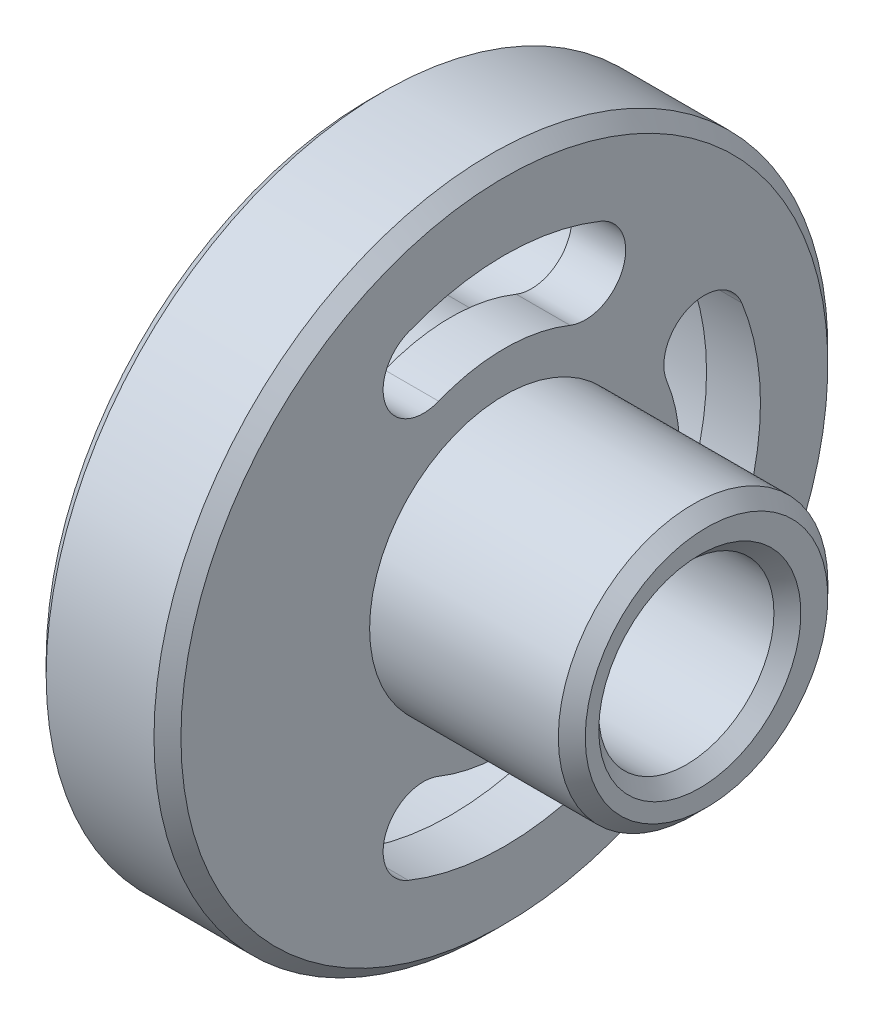
ISO-10303-21;
HEADER;
FILE_DESCRIPTION(('STEP AP214'),'2;1');
FILE_NAME('part.step','',(''),(''),'','','');
FILE_SCHEMA(('AUTOMOTIVE_DESIGN { 1 0 10303 214 1 1 1 1 }'));
ENDSEC;
DATA;
#1=APPLICATION_CONTEXT('core data for automotive mechanical design processes');
#2=APPLICATION_PROTOCOL_DEFINITION('international standard','automotive_design',2000,#1);
#3=PRODUCT_CONTEXT('',#1,'mechanical');
#4=PRODUCT('Part','Part','',(#3));
#5=PRODUCT_RELATED_PRODUCT_CATEGORY('part','',(#4));
#6=PRODUCT_DEFINITION_FORMATION('','',#4);
#7=PRODUCT_DEFINITION_CONTEXT('part definition',#1,'design');
#8=PRODUCT_DEFINITION('design','',#6,#7);
#9=PRODUCT_DEFINITION_SHAPE('','',#8);
#10=(LENGTH_UNIT() NAMED_UNIT(*) SI_UNIT(.MILLI.,.METRE.));
#11=(NAMED_UNIT(*) PLANE_ANGLE_UNIT() SI_UNIT($,.RADIAN.));
#12=(NAMED_UNIT(*) SI_UNIT($,.STERADIAN.) SOLID_ANGLE_UNIT());
#13=UNCERTAINTY_MEASURE_WITH_UNIT(LENGTH_MEASURE(1.E-05),#10,'distance_accuracy_value','');
#14=(GEOMETRIC_REPRESENTATION_CONTEXT(3) GLOBAL_UNCERTAINTY_ASSIGNED_CONTEXT((#13)) GLOBAL_UNIT_ASSIGNED_CONTEXT((#10,
#11,#12)) REPRESENTATION_CONTEXT('',''));
#15=CARTESIAN_POINT('',(0.,0.,0.));
#16=DIRECTION('',(0.,0.,1.));
#17=DIRECTION('',(1.,0.,0.));
#18=AXIS2_PLACEMENT_3D('',#15,#16,#17);
#19=CARTESIAN_POINT('',(0.,0.,0.));
#20=DIRECTION('',(1.,0.,0.));
#21=DIRECTION('',(0.,0.,-1.));
#22=AXIS2_PLACEMENT_3D('',#19,#20,#21);
#23=PLANE('',#22);
#24=CARTESIAN_POINT('',(0.,0.,0.5));
#25=DIRECTION('',(1.,0.,0.));
#26=DIRECTION('',(0.,0.,-1.));
#27=AXIS2_PLACEMENT_3D('',#24,#25,#26);
#28=CIRCLE('',#27,7.49999999999999);
#29=CARTESIAN_POINT('',(0.,0.,-6.99999999999999));
#30=VERTEX_POINT('',#29);
#31=EDGE_CURVE('E57',#30,#30,#28,.T.);
#32=ORIENTED_EDGE('',*,*,#31,.T.);
#33=EDGE_LOOP('',(#32));
#34=FACE_BOUND('',#33,.T.);
#35=CARTESIAN_POINT('',(0.,-6.00000000000006,-14.8323969741913));
#36=DIRECTION('',(-1.,0.,0.));
#37=DIRECTION('',(0.,0.,1.));
#38=AXIS2_PLACEMENT_3D('',#35,#36,#37);
#39=CIRCLE('',#38,5.);
#40=CARTESIAN_POINT('',(0.,-7.87500000000007,-19.4675210286261));
#41=VERTEX_POINT('',#40);
#42=CARTESIAN_POINT('',(0.,-4.12500000000004,-10.1972729197565));
#43=VERTEX_POINT('',#42);
#44=EDGE_CURVE('E340',#41,#43,#39,.T.);
#45=ORIENTED_EDGE('',*,*,#44,.F.);
#46=CARTESIAN_POINT('',(0.,0.,0.));
#47=DIRECTION('',(-1.,0.,0.));
#48=DIRECTION('',(0.,0.,1.));
#49=AXIS2_PLACEMENT_3D('',#46,#47,#48);
#50=CIRCLE('',#49,21.);
#51=CARTESIAN_POINT('',(0.,7.87499999999992,-19.4675210286261));
#52=VERTEX_POINT('',#51);
#53=EDGE_CURVE('E344',#52,#41,#50,.T.);
#54=ORIENTED_EDGE('',*,*,#53,.F.);
#55=CARTESIAN_POINT('',(0.,5.99999999999994,-14.8323969741913));
#56=DIRECTION('',(-1.,0.,0.));
#57=DIRECTION('',(0.,0.,1.));
#58=AXIS2_PLACEMENT_3D('',#55,#56,#57);
#59=CIRCLE('',#58,5.);
#60=CARTESIAN_POINT('',(0.,4.12499999999996,-10.1972729197565));
#61=VERTEX_POINT('',#60);
#62=EDGE_CURVE('E331',#61,#52,#59,.T.);
#63=ORIENTED_EDGE('',*,*,#62,.F.);
#64=CARTESIAN_POINT('',(0.,0.,0.));
#65=DIRECTION('',(1.,0.,0.));
#66=DIRECTION('',(0.,0.,1.));
#67=AXIS2_PLACEMENT_3D('',#64,#65,#66);
#68=CIRCLE('',#67,11.);
#69=EDGE_CURVE('E335',#43,#61,#68,.T.);
#70=ORIENTED_EDGE('',*,*,#69,.F.);
#71=EDGE_LOOP('',(#45,#54,#63,#70));
#72=FACE_BOUND('',#71,.T.);
#73=CARTESIAN_POINT('',(0.,-14.8323969741913,6.00000000000011));
#74=DIRECTION('',(-1.,0.,0.));
#75=DIRECTION('',(0.,0.,1.));
#76=AXIS2_PLACEMENT_3D('',#73,#74,#75);
#77=CIRCLE('',#76,5.);
#78=CARTESIAN_POINT('',(0.,-19.4675210286261,7.87500000000014));
#79=VERTEX_POINT('',#78);
#80=CARTESIAN_POINT('',(0.,-10.1972729197565,4.12500000000007));
#81=VERTEX_POINT('',#80);
#82=EDGE_CURVE('E296',#79,#81,#77,.T.);
#83=ORIENTED_EDGE('',*,*,#82,.F.);
#84=CARTESIAN_POINT('',(0.,0.,0.));
#85=DIRECTION('',(-1.,0.,0.));
#86=DIRECTION('',(0.,0.,1.));
#87=AXIS2_PLACEMENT_3D('',#84,#85,#86);
#88=CIRCLE('',#87,21.);
#89=CARTESIAN_POINT('',(0.,-19.4675210286262,-7.87499999999986));
#90=VERTEX_POINT('',#89);
#91=EDGE_CURVE('E300',#90,#79,#88,.T.);
#92=ORIENTED_EDGE('',*,*,#91,.F.);
#93=CARTESIAN_POINT('',(0.,-14.8323969741914,-5.99999999999989));
#94=DIRECTION('',(-1.,0.,0.));
#95=DIRECTION('',(0.,0.,1.));
#96=AXIS2_PLACEMENT_3D('',#93,#94,#95);
#97=CIRCLE('',#96,5.);
#98=CARTESIAN_POINT('',(0.,-10.1972729197566,-4.12499999999993));
#99=VERTEX_POINT('',#98);
#100=EDGE_CURVE('E287',#99,#90,#97,.T.);
#101=ORIENTED_EDGE('',*,*,#100,.F.);
#102=CARTESIAN_POINT('',(0.,0.,0.));
#103=DIRECTION('',(1.,0.,0.));
#104=DIRECTION('',(0.,0.,1.));
#105=AXIS2_PLACEMENT_3D('',#102,#103,#104);
#106=CIRCLE('',#105,11.);
#107=EDGE_CURVE('E291',#81,#99,#106,.T.);
#108=ORIENTED_EDGE('',*,*,#107,.F.);
#109=EDGE_LOOP('',(#83,#92,#101,#108));
#110=FACE_BOUND('',#109,.T.);
#111=CARTESIAN_POINT('',(0.,0.,0.));
#112=DIRECTION('',(-1.,0.,0.));
#113=DIRECTION('',(0.,0.,1.));
#114=AXIS2_PLACEMENT_3D('',#111,#112,#113);
#115=CIRCLE('',#114,21.);
#116=CARTESIAN_POINT('',(0.,19.4675210286261,7.875));
#117=VERTEX_POINT('',#116);
#118=CARTESIAN_POINT('',(0.,19.4675210286261,-7.875));
#119=VERTEX_POINT('',#118);
#120=EDGE_CURVE('E382',#117,#119,#115,.T.);
#121=ORIENTED_EDGE('',*,*,#120,.F.);
#122=CARTESIAN_POINT('',(0.,14.8323969741913,6.));
#123=DIRECTION('',(-1.,0.,0.));
#124=DIRECTION('',(0.,0.,1.));
#125=AXIS2_PLACEMENT_3D('',#122,#123,#124);
#126=CIRCLE('',#125,5.);
#127=CARTESIAN_POINT('',(0.,10.1972729197565,4.125));
#128=VERTEX_POINT('',#127);
#129=EDGE_CURVE('E347',#128,#117,#126,.T.);
#130=ORIENTED_EDGE('',*,*,#129,.F.);
#131=CARTESIAN_POINT('',(0.,0.,0.));
#132=DIRECTION('',(1.,0.,0.));
#133=DIRECTION('',(0.,0.,1.));
#134=AXIS2_PLACEMENT_3D('',#131,#132,#133);
#135=CIRCLE('',#134,11.);
#136=CARTESIAN_POINT('',(0.,10.1972729197565,-4.125));
#137=VERTEX_POINT('',#136);
#138=EDGE_CURVE('E367',#137,#128,#135,.T.);
#139=ORIENTED_EDGE('',*,*,#138,.F.);
#140=CARTESIAN_POINT('',(0.,14.8323969741913,-6.));
#141=DIRECTION('',(-1.,0.,0.));
#142=DIRECTION('',(0.,0.,1.));
#143=AXIS2_PLACEMENT_3D('',#140,#141,#142);
#144=CIRCLE('',#143,5.);
#145=EDGE_CURVE('E386',#119,#137,#144,.T.);
#146=ORIENTED_EDGE('',*,*,#145,.F.);
#147=EDGE_LOOP('',(#121,#130,#139,#146));
#148=FACE_BOUND('',#147,.T.);
#149=CARTESIAN_POINT('',(0.,0.,0.));
#150=DIRECTION('',(-1.,0.,0.));
#151=DIRECTION('',(0.,0.,1.));
#152=AXIS2_PLACEMENT_3D('',#149,#150,#151);
#153=CIRCLE('',#152,24.);
#154=CARTESIAN_POINT('',(0.,0.,24.));
#155=VERTEX_POINT('',#154);
#156=EDGE_CURVE('E429',#155,#155,#153,.T.);
#157=ORIENTED_EDGE('',*,*,#156,.T.);
#158=EDGE_LOOP('',(#157));
#159=FACE_BOUND('',#158,.T.);
#160=ADVANCED_FACE('F47',(#34,#72,#110,#148,#159),#23,.F.);
#161=CARTESIAN_POINT('',(1.,0.,0.));
#162=DIRECTION('',(1.,0.,0.));
#163=DIRECTION('',(0.,0.,-1.));
#164=AXIS2_PLACEMENT_3D('',#161,#162,#163);
#165=CONICAL_SURFACE('',#164,25.,0.785398163397449);
#166=ORIENTED_EDGE('',*,*,#156,.F.);
#167=EDGE_LOOP('',(#166));
#168=FACE_BOUND('',#167,.T.);
#169=CARTESIAN_POINT('',(1.,0.,0.));
#170=DIRECTION('',(-1.,0.,0.));
#171=DIRECTION('',(0.,0.,1.));
#172=AXIS2_PLACEMENT_3D('',#169,#170,#171);
#173=CIRCLE('',#172,25.);
#174=CARTESIAN_POINT('',(1.,0.,25.));
#175=VERTEX_POINT('',#174);
#176=EDGE_CURVE('E425',#175,#175,#173,.T.);
#177=ORIENTED_EDGE('',*,*,#176,.T.);
#178=EDGE_LOOP('',(#177));
#179=FACE_BOUND('',#178,.T.);
#180=ADVANCED_FACE('F494',(#168,#179),#165,.T.);
#181=CARTESIAN_POINT('',(0.,0.,0.));
#182=DIRECTION('',(-1.,0.,0.));
#183=DIRECTION('',(0.,0.,1.));
#184=AXIS2_PLACEMENT_3D('',#181,#182,#183);
#185=CYLINDRICAL_SURFACE('',#184,25.);
#186=ORIENTED_EDGE('',*,*,#176,.F.);
#187=EDGE_LOOP('',(#186));
#188=FACE_BOUND('',#187,.T.);
#189=CARTESIAN_POINT('',(9.,0.,0.));
#190=DIRECTION('',(-1.,0.,0.));
#191=DIRECTION('',(0.,0.,1.));
#192=AXIS2_PLACEMENT_3D('',#189,#190,#191);
#193=CIRCLE('',#192,25.);
#194=CARTESIAN_POINT('',(9.,0.,25.));
#195=VERTEX_POINT('',#194);
#196=EDGE_CURVE('E421',#195,#195,#193,.T.);
#197=ORIENTED_EDGE('',*,*,#196,.T.);
#198=EDGE_LOOP('',(#197));
#199=FACE_BOUND('',#198,.T.);
#200=ADVANCED_FACE('F499',(#188,#199),#185,.T.);
#201=CARTESIAN_POINT('',(10.,0.,0.));
#202=DIRECTION('',(-1.,0.,0.));
#203=DIRECTION('',(0.,0.,1.));
#204=AXIS2_PLACEMENT_3D('',#201,#202,#203);
#205=CONICAL_SURFACE('',#204,24.,0.785398163397449);
#206=ORIENTED_EDGE('',*,*,#196,.F.);
#207=EDGE_LOOP('',(#206));
#208=FACE_BOUND('',#207,.T.);
#209=CARTESIAN_POINT('',(10.,0.,0.));
#210=DIRECTION('',(-1.,0.,0.));
#211=DIRECTION('',(0.,0.,1.));
#212=AXIS2_PLACEMENT_3D('',#209,#210,#211);
#213=CIRCLE('',#212,24.);
#214=CARTESIAN_POINT('',(10.,0.,24.));
#215=VERTEX_POINT('',#214);
#216=EDGE_CURVE('E417',#215,#215,#213,.T.);
#217=ORIENTED_EDGE('',*,*,#216,.T.);
#218=EDGE_LOOP('',(#217));
#219=FACE_BOUND('',#218,.T.);
#220=ADVANCED_FACE('F510',(#208,#219),#205,.T.);
#221=CARTESIAN_POINT('',(10.,24.,0.));
#222=DIRECTION('',(-1.,0.,0.));
#223=DIRECTION('',(0.,0.,1.));
#224=AXIS2_PLACEMENT_3D('',#221,#222,#223);
#225=PLANE('',#224);
#226=CARTESIAN_POINT('',(10.,0.,0.));
#227=DIRECTION('',(-1.,0.,0.));
#228=DIRECTION('',(0.,0.,1.));
#229=AXIS2_PLACEMENT_3D('',#226,#227,#228);
#230=CIRCLE('',#229,13.);
#231=CARTESIAN_POINT('',(10.,12.0513225415304,-4.875));
#232=VERTEX_POINT('',#231);
#233=CARTESIAN_POINT('',(10.,12.0513225415305,4.875));
#234=VERTEX_POINT('',#233);
#235=EDGE_CURVE('E265',#232,#234,#230,.F.);
#236=ORIENTED_EDGE('',*,*,#235,.T.);
#237=CARTESIAN_POINT('',(10.,14.8323969741913,5.99999999999999));
#238=DIRECTION('',(-1.,0.,0.));
#239=DIRECTION('',(0.,0.,1.));
#240=AXIS2_PLACEMENT_3D('',#237,#238,#239);
#241=CIRCLE('',#240,3.);
#242=CARTESIAN_POINT('',(10.,17.6134714068522,7.125));
#243=VERTEX_POINT('',#242);
#244=EDGE_CURVE('E269',#234,#243,#241,.T.);
#245=ORIENTED_EDGE('',*,*,#244,.T.);
#246=CARTESIAN_POINT('',(10.,0.,0.));
#247=DIRECTION('',(-1.,0.,0.));
#248=DIRECTION('',(0.,0.,1.));
#249=AXIS2_PLACEMENT_3D('',#246,#247,#248);
#250=CIRCLE('',#249,19.);
#251=CARTESIAN_POINT('',(10.,17.6134714068522,-7.125));
#252=VERTEX_POINT('',#251);
#253=EDGE_CURVE('E257',#243,#252,#250,.T.);
#254=ORIENTED_EDGE('',*,*,#253,.T.);
#255=CARTESIAN_POINT('',(10.,14.8323969741913,-6.));
#256=DIRECTION('',(-1.,0.,0.));
#257=DIRECTION('',(0.,0.,1.));
#258=AXIS2_PLACEMENT_3D('',#255,#256,#257);
#259=CIRCLE('',#258,3.);
#260=EDGE_CURVE('E261',#252,#232,#259,.T.);
#261=ORIENTED_EDGE('',*,*,#260,.T.);
#262=EDGE_LOOP('',(#236,#245,#254,#261));
#263=FACE_BOUND('',#262,.T.);
#264=CARTESIAN_POINT('',(10.,6.00000000000054,-14.8323969741911));
#265=DIRECTION('',(-1.,0.,0.));
#266=DIRECTION('',(0.,0.,1.));
#267=AXIS2_PLACEMENT_3D('',#264,#265,#266);
#268=CIRCLE('',#267,3.);
#269=CARTESIAN_POINT('',(10.,4.87500000000044,-12.0513225415303));
#270=VERTEX_POINT('',#269);
#271=CARTESIAN_POINT('',(10.,7.12500000000065,-17.6134714068519));
#272=VERTEX_POINT('',#271);
#273=EDGE_CURVE('E234',#270,#272,#268,.T.);
#274=ORIENTED_EDGE('',*,*,#273,.T.);
#275=CARTESIAN_POINT('',(10.,0.,0.));
#276=DIRECTION('',(-1.,0.,0.));
#277=DIRECTION('',(0.,0.,1.));
#278=AXIS2_PLACEMENT_3D('',#275,#276,#277);
#279=CIRCLE('',#278,19.);
#280=CARTESIAN_POINT('',(10.,-7.12499999999935,-17.6134714068525));
#281=VERTEX_POINT('',#280);
#282=EDGE_CURVE('E223',#272,#281,#279,.T.);
#283=ORIENTED_EDGE('',*,*,#282,.T.);
#284=CARTESIAN_POINT('',(10.,-5.99999999999946,-14.8323969741915));
#285=DIRECTION('',(-1.,0.,0.));
#286=DIRECTION('',(0.,0.,1.));
#287=AXIS2_PLACEMENT_3D('',#284,#285,#286);
#288=CIRCLE('',#287,3.);
#289=CARTESIAN_POINT('',(10.,-4.87499999999955,-12.0513225415306));
#290=VERTEX_POINT('',#289);
#291=EDGE_CURVE('E208',#281,#290,#288,.T.);
#292=ORIENTED_EDGE('',*,*,#291,.T.);
#293=CARTESIAN_POINT('',(10.,0.,0.));
#294=DIRECTION('',(-1.,0.,0.));
#295=DIRECTION('',(0.,0.,1.));
#296=AXIS2_PLACEMENT_3D('',#293,#294,#295);
#297=CIRCLE('',#296,13.);
#298=EDGE_CURVE('E217',#290,#270,#297,.F.);
#299=ORIENTED_EDGE('',*,*,#298,.T.);
#300=EDGE_LOOP('',(#274,#283,#292,#299));
#301=FACE_BOUND('',#300,.T.);
#302=CARTESIAN_POINT('',(10.,-14.8323969741909,-6.00000000000109));
#303=DIRECTION('',(-1.,0.,0.));
#304=DIRECTION('',(0.,0.,1.));
#305=AXIS2_PLACEMENT_3D('',#302,#303,#304);
#306=CIRCLE('',#305,3.);
#307=CARTESIAN_POINT('',(10.,-12.0513225415301,-4.87500000000089));
#308=VERTEX_POINT('',#307);
#309=CARTESIAN_POINT('',(10.,-17.6134714068517,-7.1250000000013));
#310=VERTEX_POINT('',#309);
#311=EDGE_CURVE('E249',#308,#310,#306,.T.);
#312=ORIENTED_EDGE('',*,*,#311,.T.);
#313=CARTESIAN_POINT('',(10.,0.,0.));
#314=DIRECTION('',(-1.,0.,0.));
#315=DIRECTION('',(0.,0.,1.));
#316=AXIS2_PLACEMENT_3D('',#313,#314,#315);
#317=CIRCLE('',#316,19.);
#318=CARTESIAN_POINT('',(10.,-17.6134714068527,7.1249999999987));
#319=VERTEX_POINT('',#318);
#320=EDGE_CURVE('E253',#310,#319,#317,.T.);
#321=ORIENTED_EDGE('',*,*,#320,.T.);
#322=CARTESIAN_POINT('',(10.,-14.8323969741918,5.99999999999891));
#323=DIRECTION('',(-1.,0.,0.));
#324=DIRECTION('',(0.,0.,1.));
#325=AXIS2_PLACEMENT_3D('',#322,#323,#324);
#326=CIRCLE('',#325,3.);
#327=CARTESIAN_POINT('',(10.,-12.0513225415308,4.87499999999911));
#328=VERTEX_POINT('',#327);
#329=EDGE_CURVE('E236',#319,#328,#326,.T.);
#330=ORIENTED_EDGE('',*,*,#329,.T.);
#331=CARTESIAN_POINT('',(10.,0.,0.));
#332=DIRECTION('',(-1.,0.,0.));
#333=DIRECTION('',(0.,0.,1.));
#334=AXIS2_PLACEMENT_3D('',#331,#332,#333);
#335=CIRCLE('',#334,13.);
#336=EDGE_CURVE('E241',#328,#308,#335,.F.);
#337=ORIENTED_EDGE('',*,*,#336,.T.);
#338=EDGE_LOOP('',(#312,#321,#330,#337));
#339=FACE_BOUND('',#338,.T.);
#340=ORIENTED_EDGE('',*,*,#216,.F.);
#341=EDGE_LOOP('',(#340));
#342=FACE_BOUND('',#341,.T.);
#343=CARTESIAN_POINT('',(10.,0.,0.));
#344=DIRECTION('',(-1.,0.,0.));
#345=DIRECTION('',(0.,0.,1.));
#346=AXIS2_PLACEMENT_3D('',#343,#344,#345);
#347=CIRCLE('',#346,10.);
#348=CARTESIAN_POINT('',(10.,0.,10.));
#349=VERTEX_POINT('',#348);
#350=EDGE_CURVE('E413',#349,#349,#347,.T.);
#351=ORIENTED_EDGE('',*,*,#350,.T.);
#352=EDGE_LOOP('',(#351));
#353=FACE_BOUND('',#352,.T.);
#354=ADVANCED_FACE('F232',(#263,#301,#339,#342,#353),#225,.F.);
#355=CARTESIAN_POINT('',(0.,0.,0.));
#356=DIRECTION('',(-1.,0.,0.));
#357=DIRECTION('',(0.,0.,1.));
#358=AXIS2_PLACEMENT_3D('',#355,#356,#357);
#359=CYLINDRICAL_SURFACE('',#358,10.);
#360=ORIENTED_EDGE('',*,*,#350,.F.);
#361=EDGE_LOOP('',(#360));
#362=FACE_BOUND('',#361,.T.);
#363=CARTESIAN_POINT('',(24.,0.,0.));
#364=DIRECTION('',(-1.,0.,0.));
#365=DIRECTION('',(0.,0.,1.));
#366=AXIS2_PLACEMENT_3D('',#363,#364,#365);
#367=CIRCLE('',#366,10.);
#368=CARTESIAN_POINT('',(24.,0.,10.));
#369=VERTEX_POINT('',#368);
#370=EDGE_CURVE('E409',#369,#369,#367,.T.);
#371=ORIENTED_EDGE('',*,*,#370,.T.);
#372=EDGE_LOOP('',(#371));
#373=FACE_BOUND('',#372,.T.);
#374=ADVANCED_FACE('F517',(#362,#373),#359,.T.);
#375=CARTESIAN_POINT('',(25.,0.,0.));
#376=DIRECTION('',(-1.,0.,0.));
#377=DIRECTION('',(0.,0.,1.));
#378=AXIS2_PLACEMENT_3D('',#375,#376,#377);
#379=CONICAL_SURFACE('',#378,9.,0.785398163397447);
#380=ORIENTED_EDGE('',*,*,#370,.F.);
#381=EDGE_LOOP('',(#380));
#382=FACE_BOUND('',#381,.T.);
#383=CARTESIAN_POINT('',(25.,0.,0.));
#384=DIRECTION('',(-1.,0.,0.));
#385=DIRECTION('',(0.,0.,1.));
#386=AXIS2_PLACEMENT_3D('',#383,#384,#385);
#387=CIRCLE('',#386,9.);
#388=CARTESIAN_POINT('',(25.,0.,9.));
#389=VERTEX_POINT('',#388);
#390=EDGE_CURVE('E396',#389,#389,#387,.T.);
#391=ORIENTED_EDGE('',*,*,#390,.T.);
#392=EDGE_LOOP('',(#391));
#393=FACE_BOUND('',#392,.T.);
#394=ADVANCED_FACE('F521',(#382,#393),#379,.T.);
#395=CARTESIAN_POINT('',(25.,9.,0.));
#396=DIRECTION('',(-1.,0.,0.));
#397=DIRECTION('',(0.,0.,1.));
#398=AXIS2_PLACEMENT_3D('',#395,#396,#397);
#399=PLANE('',#398);
#400=CARTESIAN_POINT('',(25.,0.,0.5));
#401=DIRECTION('',(-1.,0.,0.));
#402=DIRECTION('',(0.,0.,1.));
#403=AXIS2_PLACEMENT_3D('',#400,#401,#402);
#404=CIRCLE('',#403,7.49999999999999);
#405=CARTESIAN_POINT('',(25.,0.,7.99999999999999));
#406=VERTEX_POINT('',#405);
#407=EDGE_CURVE('E474',#406,#406,#404,.T.);
#408=ORIENTED_EDGE('',*,*,#407,.T.);
#409=EDGE_LOOP('',(#408));
#410=FACE_BOUND('',#409,.T.);
#411=ORIENTED_EDGE('',*,*,#390,.F.);
#412=EDGE_LOOP('',(#411));
#413=FACE_BOUND('',#412,.T.);
#414=ADVANCED_FACE('F525',(#410,#413),#399,.F.);
#415=CARTESIAN_POINT('',(6.,14.8323969741913,6.));
#416=DIRECTION('',(-1.,0.,0.));
#417=DIRECTION('',(0.,0.,1.));
#418=AXIS2_PLACEMENT_3D('',#415,#416,#417);
#419=CYLINDRICAL_SURFACE('',#418,5.);
#420=ORIENTED_EDGE('',*,*,#129,.T.);
#421=DIRECTION('',(-1.,0.,0.));
#422=VECTOR('',#421,1.);
#423=CARTESIAN_POINT('',(6.,19.4675210286261,7.875));
#424=LINE('',#423,#422);
#425=CARTESIAN_POINT('',(6.,19.4675210286261,7.875));
#426=VERTEX_POINT('',#425);
#427=EDGE_CURVE('E379',#426,#117,#424,.T.);
#428=ORIENTED_EDGE('',*,*,#427,.F.);
#429=CARTESIAN_POINT('',(6.,14.8323969741913,6.));
#430=DIRECTION('',(-1.,0.,0.));
#431=DIRECTION('',(0.,0.,1.));
#432=AXIS2_PLACEMENT_3D('',#429,#430,#431);
#433=CIRCLE('',#432,5.);
#434=CARTESIAN_POINT('',(6.,10.1972729197565,4.125));
#435=VERTEX_POINT('',#434);
#436=EDGE_CURVE('E362',#435,#426,#433,.T.);
#437=ORIENTED_EDGE('',*,*,#436,.F.);
#438=DIRECTION('',(-1.,0.,0.));
#439=VECTOR('',#438,1.);
#440=CARTESIAN_POINT('',(6.,10.1972729197565,4.125));
#441=LINE('',#440,#439);
#442=EDGE_CURVE('E393',#435,#128,#441,.T.);
#443=ORIENTED_EDGE('',*,*,#442,.T.);
#444=EDGE_LOOP('',(#420,#428,#437,#443));
#445=FACE_BOUND('',#444,.T.);
#446=ADVANCED_FACE('F529',(#445),#419,.F.);
#447=CARTESIAN_POINT('',(6.,0.,0.));
#448=DIRECTION('',(-1.,0.,0.));
#449=DIRECTION('',(0.,0.,1.));
#450=AXIS2_PLACEMENT_3D('',#447,#448,#449);
#451=CYLINDRICAL_SURFACE('',#450,11.);
#452=ORIENTED_EDGE('',*,*,#138,.T.);
#453=ORIENTED_EDGE('',*,*,#442,.F.);
#454=CARTESIAN_POINT('',(6.,0.,0.));
#455=DIRECTION('',(1.,0.,0.));
#456=DIRECTION('',(0.,0.,1.));
#457=AXIS2_PLACEMENT_3D('',#454,#455,#456);
#458=CIRCLE('',#457,11.);
#459=CARTESIAN_POINT('',(6.,10.1972729197565,-4.125));
#460=VERTEX_POINT('',#459);
#461=EDGE_CURVE('E375',#460,#435,#458,.T.);
#462=ORIENTED_EDGE('',*,*,#461,.F.);
#463=DIRECTION('',(-1.,0.,0.));
#464=VECTOR('',#463,1.);
#465=CARTESIAN_POINT('',(6.,10.1972729197565,-4.125));
#466=LINE('',#465,#464);
#467=EDGE_CURVE('E397',#460,#137,#466,.T.);
#468=ORIENTED_EDGE('',*,*,#467,.T.);
#469=EDGE_LOOP('',(#452,#453,#462,#468));
#470=FACE_BOUND('',#469,.T.);
#471=ADVANCED_FACE('F533',(#470),#451,.T.);
#472=CARTESIAN_POINT('',(6.,14.8323969741913,-6.));
#473=DIRECTION('',(-1.,0.,0.));
#474=DIRECTION('',(0.,0.,1.));
#475=AXIS2_PLACEMENT_3D('',#472,#473,#474);
#476=CYLINDRICAL_SURFACE('',#475,5.);
#477=ORIENTED_EDGE('',*,*,#145,.T.);
#478=ORIENTED_EDGE('',*,*,#467,.F.);
#479=CARTESIAN_POINT('',(6.,14.8323969741913,-6.));
#480=DIRECTION('',(-1.,0.,0.));
#481=DIRECTION('',(0.,0.,1.));
#482=AXIS2_PLACEMENT_3D('',#479,#480,#481);
#483=CIRCLE('',#482,5.);
#484=CARTESIAN_POINT('',(6.,19.4675210286261,-7.875));
#485=VERTEX_POINT('',#484);
#486=EDGE_CURVE('E371',#485,#460,#483,.T.);
#487=ORIENTED_EDGE('',*,*,#486,.F.);
#488=DIRECTION('',(-1.,0.,0.));
#489=VECTOR('',#488,1.);
#490=CARTESIAN_POINT('',(6.,19.4675210286261,-7.875));
#491=LINE('',#490,#489);
#492=EDGE_CURVE('E400',#485,#119,#491,.T.);
#493=ORIENTED_EDGE('',*,*,#492,.T.);
#494=EDGE_LOOP('',(#477,#478,#487,#493));
#495=FACE_BOUND('',#494,.T.);
#496=ADVANCED_FACE('F539',(#495),#476,.F.);
#497=CARTESIAN_POINT('',(6.,0.,0.));
#498=DIRECTION('',(-1.,0.,0.));
#499=DIRECTION('',(0.,0.,1.));
#500=AXIS2_PLACEMENT_3D('',#497,#498,#499);
#501=CYLINDRICAL_SURFACE('',#500,21.);
#502=ORIENTED_EDGE('',*,*,#120,.T.);
#503=ORIENTED_EDGE('',*,*,#492,.F.);
#504=CARTESIAN_POINT('',(6.,0.,0.));
#505=DIRECTION('',(-1.,0.,0.));
#506=DIRECTION('',(0.,0.,1.));
#507=AXIS2_PLACEMENT_3D('',#504,#505,#506);
#508=CIRCLE('',#507,21.);
#509=EDGE_CURVE('E366',#426,#485,#508,.T.);
#510=ORIENTED_EDGE('',*,*,#509,.F.);
#511=ORIENTED_EDGE('',*,*,#427,.T.);
#512=EDGE_LOOP('',(#502,#503,#510,#511));
#513=FACE_BOUND('',#512,.T.);
#514=ADVANCED_FACE('F535',(#513),#501,.F.);
#515=CARTESIAN_POINT('',(6.,7.41619848709566,3.));
#516=DIRECTION('',(-1.,0.,0.));
#517=DIRECTION('',(0.,0.,1.));
#518=AXIS2_PLACEMENT_3D('',#515,#516,#517);
#519=PLANE('',#518);
#520=CARTESIAN_POINT('',(6.,14.8323969741913,5.99999999999999));
#521=DIRECTION('',(-1.,0.,0.));
#522=DIRECTION('',(0.,0.,1.));
#523=AXIS2_PLACEMENT_3D('',#520,#521,#522);
#524=CIRCLE('',#523,3.);
#525=CARTESIAN_POINT('',(6.,12.0513225415305,4.875));
#526=VERTEX_POINT('',#525);
#527=CARTESIAN_POINT('',(6.,17.6134714068522,7.125));
#528=VERTEX_POINT('',#527);
#529=EDGE_CURVE('E466',#526,#528,#524,.T.);
#530=ORIENTED_EDGE('',*,*,#529,.F.);
#531=CARTESIAN_POINT('',(6.,0.,0.));
#532=DIRECTION('',(-1.,0.,0.));
#533=DIRECTION('',(0.,0.,1.));
#534=AXIS2_PLACEMENT_3D('',#531,#532,#533);
#535=CIRCLE('',#534,13.);
#536=CARTESIAN_POINT('',(6.,12.0513225415304,-4.875));
#537=VERTEX_POINT('',#536);
#538=EDGE_CURVE('E463',#537,#526,#535,.F.);
#539=ORIENTED_EDGE('',*,*,#538,.F.);
#540=CARTESIAN_POINT('',(6.,14.8323969741913,-6.));
#541=DIRECTION('',(-1.,0.,0.));
#542=DIRECTION('',(0.,0.,1.));
#543=AXIS2_PLACEMENT_3D('',#540,#541,#542);
#544=CIRCLE('',#543,3.);
#545=CARTESIAN_POINT('',(6.,17.6134714068522,-7.125));
#546=VERTEX_POINT('',#545);
#547=EDGE_CURVE('E460',#546,#537,#544,.T.);
#548=ORIENTED_EDGE('',*,*,#547,.F.);
#549=CARTESIAN_POINT('',(6.,0.,0.));
#550=DIRECTION('',(-1.,0.,0.));
#551=DIRECTION('',(0.,0.,1.));
#552=AXIS2_PLACEMENT_3D('',#549,#550,#551);
#553=CIRCLE('',#552,19.);
#554=EDGE_CURVE('E457',#528,#546,#553,.T.);
#555=ORIENTED_EDGE('',*,*,#554,.F.);
#556=EDGE_LOOP('',(#530,#539,#548,#555));
#557=FACE_BOUND('',#556,.T.);
#558=ORIENTED_EDGE('',*,*,#436,.T.);
#559=ORIENTED_EDGE('',*,*,#509,.T.);
#560=ORIENTED_EDGE('',*,*,#486,.T.);
#561=ORIENTED_EDGE('',*,*,#461,.T.);
#562=EDGE_LOOP('',(#558,#559,#560,#561));
#563=FACE_BOUND('',#562,.T.);
#564=ADVANCED_FACE('F538',(#557,#563),#519,.T.);
#565=CARTESIAN_POINT('',(6.,0.,0.));
#566=DIRECTION('',(-1.,0.,0.));
#567=DIRECTION('',(0.,0.,1.));
#568=AXIS2_PLACEMENT_3D('',#565,#566,#567);
#569=CYLINDRICAL_SURFACE('',#568,21.);
#570=ORIENTED_EDGE('',*,*,#91,.T.);
#571=DIRECTION('',(-1.,0.,0.));
#572=VECTOR('',#571,1.);
#573=CARTESIAN_POINT('',(6.,-19.4675210286261,7.87500000000014));
#574=LINE('',#573,#572);
#575=CARTESIAN_POINT('',(6.,-19.4675210286261,7.87500000000014));
#576=VERTEX_POINT('',#575);
#577=EDGE_CURVE('E274',#576,#79,#574,.T.);
#578=ORIENTED_EDGE('',*,*,#577,.F.);
#579=CARTESIAN_POINT('',(6.,0.,0.));
#580=DIRECTION('',(-1.,0.,0.));
#581=DIRECTION('',(0.,0.,1.));
#582=AXIS2_PLACEMENT_3D('',#579,#580,#581);
#583=CIRCLE('',#582,21.);
#584=CARTESIAN_POINT('',(6.,-19.4675210286262,-7.87499999999986));
#585=VERTEX_POINT('',#584);
#586=EDGE_CURVE('E292',#585,#576,#583,.T.);
#587=ORIENTED_EDGE('',*,*,#586,.F.);
#588=DIRECTION('',(-1.,0.,0.));
#589=VECTOR('',#588,1.);
#590=CARTESIAN_POINT('',(6.,-19.4675210286262,-7.87499999999986));
#591=LINE('',#590,#589);
#592=EDGE_CURVE('E273',#585,#90,#591,.T.);
#593=ORIENTED_EDGE('',*,*,#592,.T.);
#594=EDGE_LOOP('',(#570,#578,#587,#593));
#595=FACE_BOUND('',#594,.T.);
#596=ADVANCED_FACE('F549',(#595),#569,.F.);
#597=CARTESIAN_POINT('',(6.,-14.8323969741914,-5.99999999999989));
#598=DIRECTION('',(-1.,0.,0.));
#599=DIRECTION('',(0.,0.,1.));
#600=AXIS2_PLACEMENT_3D('',#597,#598,#599);
#601=CYLINDRICAL_SURFACE('',#600,5.);
#602=ORIENTED_EDGE('',*,*,#100,.T.);
#603=ORIENTED_EDGE('',*,*,#592,.F.);
#604=CARTESIAN_POINT('',(6.,-14.8323969741914,-5.99999999999989));
#605=DIRECTION('',(-1.,0.,0.));
#606=DIRECTION('',(0.,0.,1.));
#607=AXIS2_PLACEMENT_3D('',#604,#605,#606);
#608=CIRCLE('',#607,5.);
#609=CARTESIAN_POINT('',(6.,-10.1972729197566,-4.12499999999993));
#610=VERTEX_POINT('',#609);
#611=EDGE_CURVE('E278',#610,#585,#608,.T.);
#612=ORIENTED_EDGE('',*,*,#611,.F.);
#613=DIRECTION('',(-1.,0.,0.));
#614=VECTOR('',#613,1.);
#615=CARTESIAN_POINT('',(6.,-10.1972729197566,-4.12499999999993));
#616=LINE('',#615,#614);
#617=EDGE_CURVE('E282',#610,#99,#616,.T.);
#618=ORIENTED_EDGE('',*,*,#617,.T.);
#619=EDGE_LOOP('',(#602,#603,#612,#618));
#620=FACE_BOUND('',#619,.T.);
#621=ADVANCED_FACE('F576',(#620),#601,.F.);
#622=CARTESIAN_POINT('',(6.,0.,0.));
#623=DIRECTION('',(-1.,0.,0.));
#624=DIRECTION('',(0.,0.,1.));
#625=AXIS2_PLACEMENT_3D('',#622,#623,#624);
#626=CYLINDRICAL_SURFACE('',#625,11.);
#627=ORIENTED_EDGE('',*,*,#107,.T.);
#628=ORIENTED_EDGE('',*,*,#617,.F.);
#629=CARTESIAN_POINT('',(6.,0.,0.));
#630=DIRECTION('',(1.,0.,0.));
#631=DIRECTION('',(0.,0.,1.));
#632=AXIS2_PLACEMENT_3D('',#629,#630,#631);
#633=CIRCLE('',#632,11.);
#634=CARTESIAN_POINT('',(6.,-10.1972729197565,4.12500000000007));
#635=VERTEX_POINT('',#634);
#636=EDGE_CURVE('E307',#635,#610,#633,.T.);
#637=ORIENTED_EDGE('',*,*,#636,.F.);
#638=DIRECTION('',(-1.,0.,0.));
#639=VECTOR('',#638,1.);
#640=CARTESIAN_POINT('',(6.,-10.1972729197565,4.12500000000007));
#641=LINE('',#640,#639);
#642=EDGE_CURVE('E279',#635,#81,#641,.T.);
#643=ORIENTED_EDGE('',*,*,#642,.T.);
#644=EDGE_LOOP('',(#627,#628,#637,#643));
#645=FACE_BOUND('',#644,.T.);
#646=ADVANCED_FACE('F579',(#645),#626,.T.);
#647=CARTESIAN_POINT('',(6.,-14.8323969741913,6.00000000000011));
#648=DIRECTION('',(-1.,0.,0.));
#649=DIRECTION('',(0.,0.,1.));
#650=AXIS2_PLACEMENT_3D('',#647,#648,#649);
#651=CYLINDRICAL_SURFACE('',#650,5.);
#652=ORIENTED_EDGE('',*,*,#82,.T.);
#653=ORIENTED_EDGE('',*,*,#642,.F.);
#654=CARTESIAN_POINT('',(6.,-14.8323969741913,6.00000000000011));
#655=DIRECTION('',(-1.,0.,0.));
#656=DIRECTION('',(0.,0.,1.));
#657=AXIS2_PLACEMENT_3D('',#654,#655,#656);
#658=CIRCLE('',#657,5.);
#659=EDGE_CURVE('E311',#576,#635,#658,.T.);
#660=ORIENTED_EDGE('',*,*,#659,.F.);
#661=ORIENTED_EDGE('',*,*,#577,.T.);
#662=EDGE_LOOP('',(#652,#653,#660,#661));
#663=FACE_BOUND('',#662,.T.);
#664=ADVANCED_FACE('F574',(#663),#651,.F.);
#665=CARTESIAN_POINT('',(6.,-7.41619848709565,3.00000000000005));
#666=DIRECTION('',(-1.,0.,0.));
#667=DIRECTION('',(0.,0.,1.));
#668=AXIS2_PLACEMENT_3D('',#665,#666,#667);
#669=PLANE('',#668);
#670=CARTESIAN_POINT('',(6.,0.,0.));
#671=DIRECTION('',(-1.,0.,0.));
#672=DIRECTION('',(0.,0.,1.));
#673=AXIS2_PLACEMENT_3D('',#670,#671,#672);
#674=CIRCLE('',#673,19.);
#675=CARTESIAN_POINT('',(6.,-17.6134714068517,-7.1250000000013));
#676=VERTEX_POINT('',#675);
#677=CARTESIAN_POINT('',(6.,-17.6134714068527,7.1249999999987));
#678=VERTEX_POINT('',#677);
#679=EDGE_CURVE('E453',#676,#678,#674,.T.);
#680=ORIENTED_EDGE('',*,*,#679,.F.);
#681=CARTESIAN_POINT('',(6.,-14.8323969741909,-6.00000000000109));
#682=DIRECTION('',(-1.,0.,0.));
#683=DIRECTION('',(0.,0.,1.));
#684=AXIS2_PLACEMENT_3D('',#681,#682,#683);
#685=CIRCLE('',#684,3.);
#686=CARTESIAN_POINT('',(6.,-12.0513225415301,-4.87500000000089));
#687=VERTEX_POINT('',#686);
#688=EDGE_CURVE('E450',#687,#676,#685,.T.);
#689=ORIENTED_EDGE('',*,*,#688,.F.);
#690=CARTESIAN_POINT('',(6.,0.,0.));
#691=DIRECTION('',(-1.,0.,0.));
#692=DIRECTION('',(0.,0.,1.));
#693=AXIS2_PLACEMENT_3D('',#690,#691,#692);
#694=CIRCLE('',#693,13.);
#695=CARTESIAN_POINT('',(6.,-12.0513225415308,4.87499999999911));
#696=VERTEX_POINT('',#695);
#697=EDGE_CURVE('E447',#696,#687,#694,.F.);
#698=ORIENTED_EDGE('',*,*,#697,.F.);
#699=CARTESIAN_POINT('',(6.,-14.8323969741918,5.99999999999891));
#700=DIRECTION('',(-1.,0.,0.));
#701=DIRECTION('',(0.,0.,1.));
#702=AXIS2_PLACEMENT_3D('',#699,#700,#701);
#703=CIRCLE('',#702,3.);
#704=EDGE_CURVE('E444',#678,#696,#703,.T.);
#705=ORIENTED_EDGE('',*,*,#704,.F.);
#706=EDGE_LOOP('',(#680,#689,#698,#705));
#707=FACE_BOUND('',#706,.T.);
#708=ORIENTED_EDGE('',*,*,#586,.T.);
#709=ORIENTED_EDGE('',*,*,#659,.T.);
#710=ORIENTED_EDGE('',*,*,#636,.T.);
#711=ORIENTED_EDGE('',*,*,#611,.T.);
#712=EDGE_LOOP('',(#708,#709,#710,#711));
#713=FACE_BOUND('',#712,.T.);
#714=ADVANCED_FACE('F570',(#707,#713),#669,.T.);
#715=CARTESIAN_POINT('',(6.,0.,0.));
#716=DIRECTION('',(-1.,0.,0.));
#717=DIRECTION('',(0.,0.,1.));
#718=AXIS2_PLACEMENT_3D('',#715,#716,#717);
#719=CYLINDRICAL_SURFACE('',#718,21.);
#720=ORIENTED_EDGE('',*,*,#53,.T.);
#721=DIRECTION('',(-1.,0.,0.));
#722=VECTOR('',#721,1.);
#723=CARTESIAN_POINT('',(6.,-7.87500000000007,-19.4675210286261));
#724=LINE('',#723,#722);
#725=CARTESIAN_POINT('',(6.,-7.87500000000007,-19.4675210286261));
#726=VERTEX_POINT('',#725);
#727=EDGE_CURVE('E318',#726,#41,#724,.T.);
#728=ORIENTED_EDGE('',*,*,#727,.F.);
#729=CARTESIAN_POINT('',(6.,0.,0.));
#730=DIRECTION('',(-1.,0.,0.));
#731=DIRECTION('',(0.,0.,1.));
#732=AXIS2_PLACEMENT_3D('',#729,#730,#731);
#733=CIRCLE('',#732,21.);
#734=CARTESIAN_POINT('',(6.,7.87499999999992,-19.4675210286261));
#735=VERTEX_POINT('',#734);
#736=EDGE_CURVE('E336',#735,#726,#733,.T.);
#737=ORIENTED_EDGE('',*,*,#736,.F.);
#738=DIRECTION('',(-1.,0.,0.));
#739=VECTOR('',#738,1.);
#740=CARTESIAN_POINT('',(6.,7.87499999999992,-19.4675210286261));
#741=LINE('',#740,#739);
#742=EDGE_CURVE('E303',#735,#52,#741,.T.);
#743=ORIENTED_EDGE('',*,*,#742,.T.);
#744=EDGE_LOOP('',(#720,#728,#737,#743));
#745=FACE_BOUND('',#744,.T.);
#746=ADVANCED_FACE('F560',(#745),#719,.F.);
#747=CARTESIAN_POINT('',(6.,5.99999999999994,-14.8323969741913));
#748=DIRECTION('',(-1.,0.,0.));
#749=DIRECTION('',(0.,0.,1.));
#750=AXIS2_PLACEMENT_3D('',#747,#748,#749);
#751=CYLINDRICAL_SURFACE('',#750,5.);
#752=ORIENTED_EDGE('',*,*,#62,.T.);
#753=ORIENTED_EDGE('',*,*,#742,.F.);
#754=CARTESIAN_POINT('',(6.,5.99999999999994,-14.8323969741913));
#755=DIRECTION('',(-1.,0.,0.));
#756=DIRECTION('',(0.,0.,1.));
#757=AXIS2_PLACEMENT_3D('',#754,#755,#756);
#758=CIRCLE('',#757,5.);
#759=CARTESIAN_POINT('',(6.,4.12499999999996,-10.1972729197565));
#760=VERTEX_POINT('',#759);
#761=EDGE_CURVE('E322',#760,#735,#758,.T.);
#762=ORIENTED_EDGE('',*,*,#761,.F.);
#763=DIRECTION('',(-1.,0.,0.));
#764=VECTOR('',#763,1.);
#765=CARTESIAN_POINT('',(6.,4.12499999999996,-10.1972729197565));
#766=LINE('',#765,#764);
#767=EDGE_CURVE('E326',#760,#61,#766,.T.);
#768=ORIENTED_EDGE('',*,*,#767,.T.);
#769=EDGE_LOOP('',(#752,#753,#762,#768));
#770=FACE_BOUND('',#769,.T.);
#771=ADVANCED_FACE('F556',(#770),#751,.F.);
#772=CARTESIAN_POINT('',(6.,0.,0.));
#773=DIRECTION('',(-1.,0.,0.));
#774=DIRECTION('',(0.,0.,1.));
#775=AXIS2_PLACEMENT_3D('',#772,#773,#774);
#776=CYLINDRICAL_SURFACE('',#775,11.);
#777=ORIENTED_EDGE('',*,*,#69,.T.);
#778=ORIENTED_EDGE('',*,*,#767,.F.);
#779=CARTESIAN_POINT('',(6.,0.,0.));
#780=DIRECTION('',(1.,0.,0.));
#781=DIRECTION('',(0.,0.,1.));
#782=AXIS2_PLACEMENT_3D('',#779,#780,#781);
#783=CIRCLE('',#782,11.);
#784=CARTESIAN_POINT('',(6.,-4.12500000000004,-10.1972729197565));
#785=VERTEX_POINT('',#784);
#786=EDGE_CURVE('E351',#785,#760,#783,.T.);
#787=ORIENTED_EDGE('',*,*,#786,.F.);
#788=DIRECTION('',(-1.,0.,0.));
#789=VECTOR('',#788,1.);
#790=CARTESIAN_POINT('',(6.,-4.12500000000004,-10.1972729197565));
#791=LINE('',#790,#789);
#792=EDGE_CURVE('E323',#785,#43,#791,.T.);
#793=ORIENTED_EDGE('',*,*,#792,.T.);
#794=EDGE_LOOP('',(#777,#778,#787,#793));
#795=FACE_BOUND('',#794,.T.);
#796=ADVANCED_FACE('F559',(#795),#776,.T.);
#797=CARTESIAN_POINT('',(6.,-6.00000000000006,-14.8323969741913));
#798=DIRECTION('',(-1.,0.,0.));
#799=DIRECTION('',(0.,0.,1.));
#800=AXIS2_PLACEMENT_3D('',#797,#798,#799);
#801=CYLINDRICAL_SURFACE('',#800,5.);
#802=ORIENTED_EDGE('',*,*,#44,.T.);
#803=ORIENTED_EDGE('',*,*,#792,.F.);
#804=CARTESIAN_POINT('',(6.,-6.00000000000006,-14.8323969741913));
#805=DIRECTION('',(-1.,0.,0.));
#806=DIRECTION('',(0.,0.,1.));
#807=AXIS2_PLACEMENT_3D('',#804,#805,#806);
#808=CIRCLE('',#807,5.);
#809=EDGE_CURVE('E355',#726,#785,#808,.T.);
#810=ORIENTED_EDGE('',*,*,#809,.F.);
#811=ORIENTED_EDGE('',*,*,#727,.T.);
#812=EDGE_LOOP('',(#802,#803,#810,#811));
#813=FACE_BOUND('',#812,.T.);
#814=ADVANCED_FACE('F554',(#813),#801,.F.);
#815=CARTESIAN_POINT('',(6.,-3.00000000000003,-7.41619848709565));
#816=DIRECTION('',(-1.,0.,0.));
#817=DIRECTION('',(0.,0.,1.));
#818=AXIS2_PLACEMENT_3D('',#815,#816,#817);
#819=PLANE('',#818);
#820=CARTESIAN_POINT('',(6.,0.,0.));
#821=DIRECTION('',(-1.,0.,0.));
#822=DIRECTION('',(0.,0.,1.));
#823=AXIS2_PLACEMENT_3D('',#820,#821,#822);
#824=CIRCLE('',#823,19.);
#825=CARTESIAN_POINT('',(6.,7.12500000000065,-17.6134714068519));
#826=VERTEX_POINT('',#825);
#827=CARTESIAN_POINT('',(6.,-7.12499999999935,-17.6134714068525));
#828=VERTEX_POINT('',#827);
#829=EDGE_CURVE('E226',#826,#828,#824,.T.);
#830=ORIENTED_EDGE('',*,*,#829,.F.);
#831=CARTESIAN_POINT('',(6.,6.00000000000054,-14.8323969741911));
#832=DIRECTION('',(-1.,0.,0.));
#833=DIRECTION('',(0.,0.,1.));
#834=AXIS2_PLACEMENT_3D('',#831,#832,#833);
#835=CIRCLE('',#834,3.);
#836=CARTESIAN_POINT('',(6.,4.87500000000044,-12.0513225415303));
#837=VERTEX_POINT('',#836);
#838=EDGE_CURVE('E439',#837,#826,#835,.T.);
#839=ORIENTED_EDGE('',*,*,#838,.F.);
#840=CARTESIAN_POINT('',(6.,0.,0.));
#841=DIRECTION('',(-1.,0.,0.));
#842=DIRECTION('',(0.,0.,1.));
#843=AXIS2_PLACEMENT_3D('',#840,#841,#842);
#844=CIRCLE('',#843,13.);
#845=CARTESIAN_POINT('',(6.,-4.87499999999955,-12.0513225415306));
#846=VERTEX_POINT('',#845);
#847=EDGE_CURVE('E436',#846,#837,#844,.F.);
#848=ORIENTED_EDGE('',*,*,#847,.F.);
#849=CARTESIAN_POINT('',(6.,-5.99999999999946,-14.8323969741915));
#850=DIRECTION('',(-1.,0.,0.));
#851=DIRECTION('',(0.,0.,1.));
#852=AXIS2_PLACEMENT_3D('',#849,#850,#851);
#853=CIRCLE('',#852,3.);
#854=EDGE_CURVE('E433',#828,#846,#853,.T.);
#855=ORIENTED_EDGE('',*,*,#854,.F.);
#856=EDGE_LOOP('',(#830,#839,#848,#855));
#857=FACE_BOUND('',#856,.T.);
#858=ORIENTED_EDGE('',*,*,#736,.T.);
#859=ORIENTED_EDGE('',*,*,#809,.T.);
#860=ORIENTED_EDGE('',*,*,#786,.T.);
#861=ORIENTED_EDGE('',*,*,#761,.T.);
#862=EDGE_LOOP('',(#858,#859,#860,#861));
#863=FACE_BOUND('',#862,.T.);
#864=ADVANCED_FACE('F551',(#857,#863),#819,.T.);
#865=CARTESIAN_POINT('',(25.,0.,0.));
#866=DIRECTION('',(-1.,0.,0.));
#867=DIRECTION('',(0.,0.,1.));
#868=AXIS2_PLACEMENT_3D('',#865,#866,#867);
#869=CYLINDRICAL_SURFACE('',#868,19.);
#870=DIRECTION('',(-1.,0.,0.));
#871=VECTOR('',#870,1.);
#872=CARTESIAN_POINT('',(25.,7.12500000000065,-17.6134714068519));
#873=LINE('',#872,#871);
#874=EDGE_CURVE('E887',#272,#826,#873,.T.);
#875=ORIENTED_EDGE('',*,*,#874,.T.);
#876=ORIENTED_EDGE('',*,*,#829,.T.);
#877=DIRECTION('',(-1.,0.,0.));
#878=VECTOR('',#877,1.);
#879=CARTESIAN_POINT('',(25.,-7.12499999999935,-17.6134714068525));
#880=LINE('',#879,#878);
#881=EDGE_CURVE('E211',#281,#828,#880,.T.);
#882=ORIENTED_EDGE('',*,*,#881,.F.);
#883=ORIENTED_EDGE('',*,*,#282,.F.);
#884=EDGE_LOOP('',(#875,#876,#882,#883));
#885=FACE_BOUND('',#884,.T.);
#886=ADVANCED_FACE('F222',(#885),#869,.F.);
#887=CARTESIAN_POINT('',(25.,6.00000000000054,-14.8323969741911));
#888=DIRECTION('',(-1.,0.,0.));
#889=DIRECTION('',(0.,0.,1.));
#890=AXIS2_PLACEMENT_3D('',#887,#888,#889);
#891=CYLINDRICAL_SURFACE('',#890,3.);
#892=DIRECTION('',(-1.,0.,0.));
#893=VECTOR('',#892,1.);
#894=CARTESIAN_POINT('',(25.,4.87500000000044,-12.0513225415303));
#895=LINE('',#894,#893);
#896=EDGE_CURVE('E883',#270,#837,#895,.T.);
#897=ORIENTED_EDGE('',*,*,#896,.T.);
#898=ORIENTED_EDGE('',*,*,#838,.T.);
#899=ORIENTED_EDGE('',*,*,#874,.F.);
#900=ORIENTED_EDGE('',*,*,#273,.F.);
#901=EDGE_LOOP('',(#897,#898,#899,#900));
#902=FACE_BOUND('',#901,.T.);
#903=ADVANCED_FACE('F607',(#902),#891,.F.);
#904=CARTESIAN_POINT('',(25.,0.,0.));
#905=DIRECTION('',(-1.,0.,0.));
#906=DIRECTION('',(0.,0.,1.));
#907=AXIS2_PLACEMENT_3D('',#904,#905,#906);
#908=CYLINDRICAL_SURFACE('',#907,13.);
#909=DIRECTION('',(-1.,0.,0.));
#910=VECTOR('',#909,1.);
#911=CARTESIAN_POINT('',(25.,-4.87499999999955,-12.0513225415306));
#912=LINE('',#911,#910);
#913=EDGE_CURVE('E72',#290,#846,#912,.T.);
#914=ORIENTED_EDGE('',*,*,#913,.T.);
#915=ORIENTED_EDGE('',*,*,#847,.T.);
#916=ORIENTED_EDGE('',*,*,#896,.F.);
#917=ORIENTED_EDGE('',*,*,#298,.F.);
#918=EDGE_LOOP('',(#914,#915,#916,#917));
#919=FACE_BOUND('',#918,.T.);
#920=ADVANCED_FACE('F610',(#919),#908,.T.);
#921=CARTESIAN_POINT('',(25.,-5.99999999999946,-14.8323969741915));
#922=DIRECTION('',(-1.,0.,0.));
#923=DIRECTION('',(0.,0.,1.));
#924=AXIS2_PLACEMENT_3D('',#921,#922,#923);
#925=CYLINDRICAL_SURFACE('',#924,3.);
#926=ORIENTED_EDGE('',*,*,#881,.T.);
#927=ORIENTED_EDGE('',*,*,#854,.T.);
#928=ORIENTED_EDGE('',*,*,#913,.F.);
#929=ORIENTED_EDGE('',*,*,#291,.F.);
#930=EDGE_LOOP('',(#926,#927,#928,#929));
#931=FACE_BOUND('',#930,.T.);
#932=ADVANCED_FACE('F210',(#931),#925,.F.);
#933=CARTESIAN_POINT('',(25.,0.,0.));
#934=DIRECTION('',(-1.,0.,0.));
#935=DIRECTION('',(0.,0.,1.));
#936=AXIS2_PLACEMENT_3D('',#933,#934,#935);
#937=CYLINDRICAL_SURFACE('',#936,19.);
#938=DIRECTION('',(-1.,0.,0.));
#939=VECTOR('',#938,1.);
#940=CARTESIAN_POINT('',(25.,-17.6134714068517,-7.1250000000013));
#941=LINE('',#940,#939);
#942=EDGE_CURVE('E901',#310,#676,#941,.T.);
#943=ORIENTED_EDGE('',*,*,#942,.T.);
#944=ORIENTED_EDGE('',*,*,#679,.T.);
#945=DIRECTION('',(-1.,0.,0.));
#946=VECTOR('',#945,1.);
#947=CARTESIAN_POINT('',(25.,-17.6134714068527,7.1249999999987));
#948=LINE('',#947,#946);
#949=EDGE_CURVE('E890',#319,#678,#948,.T.);
#950=ORIENTED_EDGE('',*,*,#949,.F.);
#951=ORIENTED_EDGE('',*,*,#320,.F.);
#952=EDGE_LOOP('',(#943,#944,#950,#951));
#953=FACE_BOUND('',#952,.T.);
#954=ADVANCED_FACE('F594',(#953),#937,.F.);
#955=CARTESIAN_POINT('',(25.,-14.8323969741909,-6.00000000000109));
#956=DIRECTION('',(-1.,0.,0.));
#957=DIRECTION('',(0.,0.,1.));
#958=AXIS2_PLACEMENT_3D('',#955,#956,#957);
#959=CYLINDRICAL_SURFACE('',#958,3.);
#960=DIRECTION('',(-1.,0.,0.));
#961=VECTOR('',#960,1.);
#962=CARTESIAN_POINT('',(25.,-12.0513225415301,-4.87500000000089));
#963=LINE('',#962,#961);
#964=EDGE_CURVE('E897',#308,#687,#963,.T.);
#965=ORIENTED_EDGE('',*,*,#964,.T.);
#966=ORIENTED_EDGE('',*,*,#688,.T.);
#967=ORIENTED_EDGE('',*,*,#942,.F.);
#968=ORIENTED_EDGE('',*,*,#311,.F.);
#969=EDGE_LOOP('',(#965,#966,#967,#968));
#970=FACE_BOUND('',#969,.T.);
#971=ADVANCED_FACE('F590',(#970),#959,.F.);
#972=CARTESIAN_POINT('',(25.,0.,0.));
#973=DIRECTION('',(-1.,0.,0.));
#974=DIRECTION('',(0.,0.,1.));
#975=AXIS2_PLACEMENT_3D('',#972,#973,#974);
#976=CYLINDRICAL_SURFACE('',#975,13.);
#977=DIRECTION('',(-1.,0.,0.));
#978=VECTOR('',#977,1.);
#979=CARTESIAN_POINT('',(25.,-12.0513225415308,4.87499999999911));
#980=LINE('',#979,#978);
#981=EDGE_CURVE('E893',#328,#696,#980,.T.);
#982=ORIENTED_EDGE('',*,*,#981,.T.);
#983=ORIENTED_EDGE('',*,*,#697,.T.);
#984=ORIENTED_EDGE('',*,*,#964,.F.);
#985=ORIENTED_EDGE('',*,*,#336,.F.);
#986=EDGE_LOOP('',(#982,#983,#984,#985));
#987=FACE_BOUND('',#986,.T.);
#988=ADVANCED_FACE('F593',(#987),#976,.T.);
#989=CARTESIAN_POINT('',(25.,-14.8323969741918,5.99999999999891));
#990=DIRECTION('',(-1.,0.,0.));
#991=DIRECTION('',(0.,0.,1.));
#992=AXIS2_PLACEMENT_3D('',#989,#990,#991);
#993=CYLINDRICAL_SURFACE('',#992,3.);
#994=ORIENTED_EDGE('',*,*,#949,.T.);
#995=ORIENTED_EDGE('',*,*,#704,.T.);
#996=ORIENTED_EDGE('',*,*,#981,.F.);
#997=ORIENTED_EDGE('',*,*,#329,.F.);
#998=EDGE_LOOP('',(#994,#995,#996,#997));
#999=FACE_BOUND('',#998,.T.);
#1000=ADVANCED_FACE('F598',(#999),#993,.F.);
#1001=CARTESIAN_POINT('',(25.,14.8323969741913,5.99999999999999));
#1002=DIRECTION('',(-1.,0.,0.));
#1003=DIRECTION('',(0.,0.,1.));
#1004=AXIS2_PLACEMENT_3D('',#1001,#1002,#1003);
#1005=CYLINDRICAL_SURFACE('',#1004,3.);
#1006=DIRECTION('',(-1.,0.,0.));
#1007=VECTOR('',#1006,1.);
#1008=CARTESIAN_POINT('',(25.,12.0513225415305,4.875));
#1009=LINE('',#1008,#1007);
#1010=EDGE_CURVE('E218',#234,#526,#1009,.T.);
#1011=ORIENTED_EDGE('',*,*,#1010,.T.);
#1012=ORIENTED_EDGE('',*,*,#529,.T.);
#1013=DIRECTION('',(-1.,0.,0.));
#1014=VECTOR('',#1013,1.);
#1015=CARTESIAN_POINT('',(25.,17.6134714068522,7.125));
#1016=LINE('',#1015,#1014);
#1017=EDGE_CURVE('E229',#243,#528,#1016,.T.);
#1018=ORIENTED_EDGE('',*,*,#1017,.F.);
#1019=ORIENTED_EDGE('',*,*,#244,.F.);
#1020=EDGE_LOOP('',(#1011,#1012,#1018,#1019));
#1021=FACE_BOUND('',#1020,.T.);
#1022=ADVANCED_FACE('F602',(#1021),#1005,.F.);
#1023=CARTESIAN_POINT('',(25.,0.,0.));
#1024=DIRECTION('',(-1.,0.,0.));
#1025=DIRECTION('',(0.,0.,1.));
#1026=AXIS2_PLACEMENT_3D('',#1023,#1024,#1025);
#1027=CYLINDRICAL_SURFACE('',#1026,13.);
#1028=DIRECTION('',(-1.,0.,0.));
#1029=VECTOR('',#1028,1.);
#1030=CARTESIAN_POINT('',(25.,12.0513225415304,-4.875));
#1031=LINE('',#1030,#1029);
#1032=EDGE_CURVE('E863',#232,#537,#1031,.T.);
#1033=ORIENTED_EDGE('',*,*,#1032,.T.);
#1034=ORIENTED_EDGE('',*,*,#538,.T.);
#1035=ORIENTED_EDGE('',*,*,#1010,.F.);
#1036=ORIENTED_EDGE('',*,*,#235,.F.);
#1037=EDGE_LOOP('',(#1033,#1034,#1035,#1036));
#1038=FACE_BOUND('',#1037,.T.);
#1039=ADVANCED_FACE('F621',(#1038),#1027,.T.);
#1040=CARTESIAN_POINT('',(25.,14.8323969741913,-6.));
#1041=DIRECTION('',(-1.,0.,0.));
#1042=DIRECTION('',(0.,0.,1.));
#1043=AXIS2_PLACEMENT_3D('',#1040,#1041,#1042);
#1044=CYLINDRICAL_SURFACE('',#1043,3.);
#1045=DIRECTION('',(-1.,0.,0.));
#1046=VECTOR('',#1045,1.);
#1047=CARTESIAN_POINT('',(25.,17.6134714068522,-7.125));
#1048=LINE('',#1047,#1046);
#1049=EDGE_CURVE('E64',#252,#546,#1048,.T.);
#1050=ORIENTED_EDGE('',*,*,#1049,.T.);
#1051=ORIENTED_EDGE('',*,*,#547,.T.);
#1052=ORIENTED_EDGE('',*,*,#1032,.F.);
#1053=ORIENTED_EDGE('',*,*,#260,.F.);
#1054=EDGE_LOOP('',(#1050,#1051,#1052,#1053));
#1055=FACE_BOUND('',#1054,.T.);
#1056=ADVANCED_FACE('F626',(#1055),#1044,.F.);
#1057=CARTESIAN_POINT('',(25.,0.,0.));
#1058=DIRECTION('',(-1.,0.,0.));
#1059=DIRECTION('',(0.,0.,1.));
#1060=AXIS2_PLACEMENT_3D('',#1057,#1058,#1059);
#1061=CYLINDRICAL_SURFACE('',#1060,19.);
#1062=ORIENTED_EDGE('',*,*,#1017,.T.);
#1063=ORIENTED_EDGE('',*,*,#554,.T.);
#1064=ORIENTED_EDGE('',*,*,#1049,.F.);
#1065=ORIENTED_EDGE('',*,*,#253,.F.);
#1066=EDGE_LOOP('',(#1062,#1063,#1064,#1065));
#1067=FACE_BOUND('',#1066,.T.);
#1068=ADVANCED_FACE('F623',(#1067),#1061,.F.);
#1069=CARTESIAN_POINT('',(0.,0.,0.5));
#1070=DIRECTION('',(1.,0.,0.));
#1071=DIRECTION('',(0.,0.,-1.));
#1072=AXIS2_PLACEMENT_3D('',#1069,#1070,#1071);
#1073=CYLINDRICAL_SURFACE('',#1072,6.5);
#1074=CARTESIAN_POINT('',(0.999999999999985,0.,0.5));
#1075=DIRECTION('',(1.,0.,0.));
#1076=DIRECTION('',(0.,0.,-1.));
#1077=AXIS2_PLACEMENT_3D('',#1074,#1075,#1076);
#1078=CIRCLE('',#1077,6.5);
#1079=CARTESIAN_POINT('',(0.999999999999985,0.,-6.));
#1080=VERTEX_POINT('',#1079);
#1081=EDGE_CURVE('E11',#1080,#1080,#1078,.F.);
#1082=ORIENTED_EDGE('',*,*,#1081,.T.);
#1083=EDGE_LOOP('',(#1082));
#1084=FACE_BOUND('',#1083,.T.);
#1085=CARTESIAN_POINT('',(24.,0.,0.5));
#1086=DIRECTION('',(-1.,0.,0.));
#1087=DIRECTION('',(0.,0.,1.));
#1088=AXIS2_PLACEMENT_3D('',#1085,#1086,#1087);
#1089=CIRCLE('',#1088,6.5);
#1090=CARTESIAN_POINT('',(24.,0.,7.));
#1091=VERTEX_POINT('',#1090);
#1092=EDGE_CURVE('E470',#1091,#1091,#1089,.F.);
#1093=ORIENTED_EDGE('',*,*,#1092,.T.);
#1094=EDGE_LOOP('',(#1093));
#1095=FACE_BOUND('',#1094,.T.);
#1096=ADVANCED_FACE('F490',(#1084,#1095),#1073,.F.);
#1097=CARTESIAN_POINT('',(24.,0.,0.5));
#1098=DIRECTION('',(1.,0.,0.));
#1099=DIRECTION('',(0.,0.,-1.));
#1100=AXIS2_PLACEMENT_3D('',#1097,#1098,#1099);
#1101=CONICAL_SURFACE('',#1100,6.5,0.785398163397452);
#1102=ORIENTED_EDGE('',*,*,#407,.F.);
#1103=EDGE_LOOP('',(#1102));
#1104=FACE_BOUND('',#1103,.T.);
#1105=ORIENTED_EDGE('',*,*,#1092,.F.);
#1106=EDGE_LOOP('',(#1105));
#1107=FACE_BOUND('',#1106,.T.);
#1108=ADVANCED_FACE('F484',(#1104,#1107),#1101,.F.);
#1109=CARTESIAN_POINT('',(0.,0.,0.5));
#1110=DIRECTION('',(-1.,0.,0.));
#1111=DIRECTION('',(0.,0.,1.));
#1112=AXIS2_PLACEMENT_3D('',#1109,#1110,#1111);
#1113=CONICAL_SURFACE('',#1112,7.49999999999999,0.785398163397449);
#1114=ORIENTED_EDGE('',*,*,#1081,.F.);
#1115=EDGE_LOOP('',(#1114));
#1116=FACE_BOUND('',#1115,.T.);
#1117=ORIENTED_EDGE('',*,*,#31,.F.);
#1118=EDGE_LOOP('',(#1117));
#1119=FACE_BOUND('',#1118,.T.);
#1120=ADVANCED_FACE('F50',(#1116,#1119),#1113,.F.);
#1121=CLOSED_SHELL('',(#160,#180,#200,#220,#354,#374,#394,#414,#446,#471,#496,#514,#564,#596,
#621,#646,#664,#714,#746,#771,#796,#814,#864,#886,#903,#920,#932,#954,#971,#988,#1000,#1022,
#1039,#1056,#1068,#1096,#1108,#1120));
#1122=MANIFOLD_SOLID_BREP('B2',#1121);
#1123=ADVANCED_BREP_SHAPE_REPRESENTATION('',(#18,#1122),#14);
#1124=SHAPE_DEFINITION_REPRESENTATION(#9,#1123);
ENDSEC;
END-ISO-10303-21;
